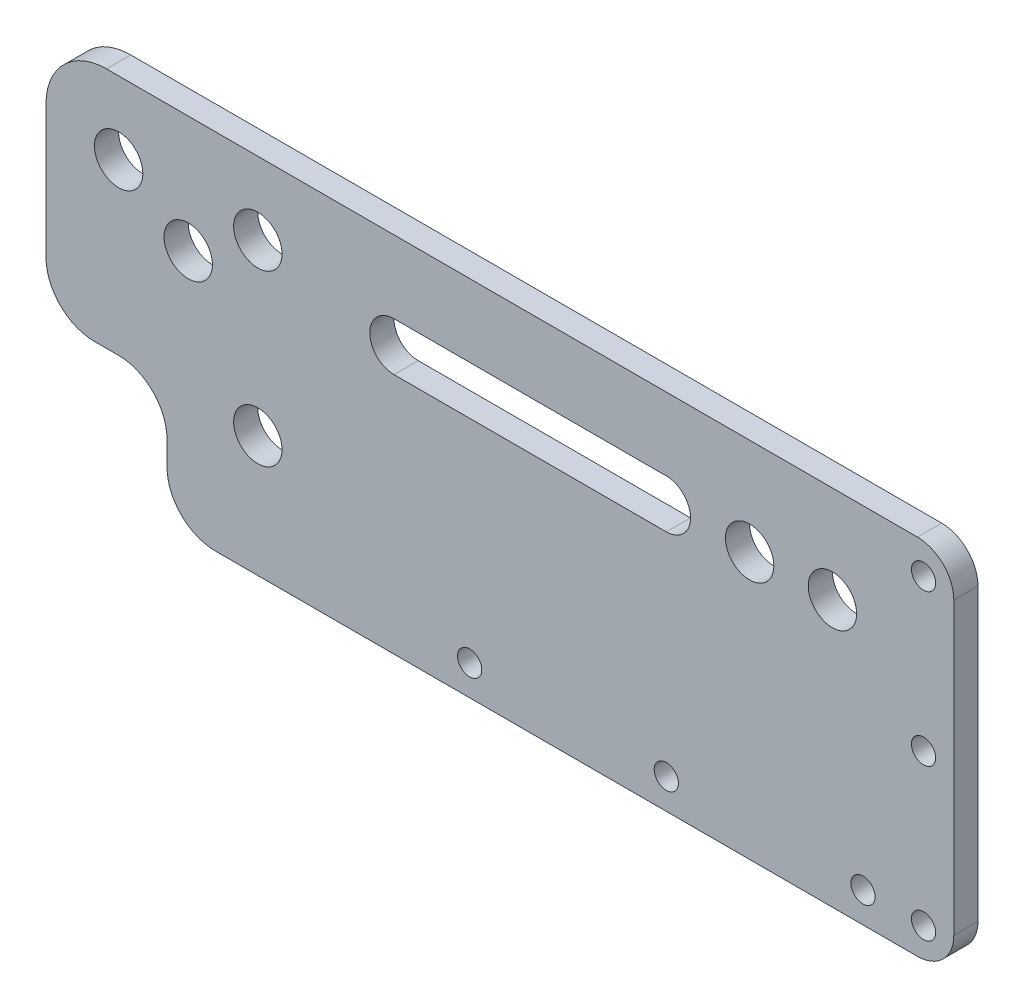
ISO-10303-21;
HEADER;
FILE_DESCRIPTION(('STEP AP214'),'2;1');
FILE_NAME('part.step','',(''),(''),'','','');
FILE_SCHEMA(('AUTOMOTIVE_DESIGN { 1 0 10303 214 1 1 1 1 }'));
ENDSEC;
DATA;
#1=APPLICATION_CONTEXT('core data for automotive mechanical design processes');
#2=APPLICATION_PROTOCOL_DEFINITION('international standard','automotive_design',2000,#1);
#3=PRODUCT_CONTEXT('',#1,'mechanical');
#4=PRODUCT('Part','Part','',(#3));
#5=PRODUCT_RELATED_PRODUCT_CATEGORY('part','',(#4));
#6=PRODUCT_DEFINITION_FORMATION('','',#4);
#7=PRODUCT_DEFINITION_CONTEXT('part definition',#1,'design');
#8=PRODUCT_DEFINITION('design','',#6,#7);
#9=PRODUCT_DEFINITION_SHAPE('','',#8);
#10=(LENGTH_UNIT() NAMED_UNIT(*) SI_UNIT(.MILLI.,.METRE.));
#11=(NAMED_UNIT(*) PLANE_ANGLE_UNIT() SI_UNIT($,.RADIAN.));
#12=(NAMED_UNIT(*) SI_UNIT($,.STERADIAN.) SOLID_ANGLE_UNIT());
#13=UNCERTAINTY_MEASURE_WITH_UNIT(LENGTH_MEASURE(1.E-05),#10,'distance_accuracy_value','');
#14=(GEOMETRIC_REPRESENTATION_CONTEXT(3) GLOBAL_UNCERTAINTY_ASSIGNED_CONTEXT((#13)) GLOBAL_UNIT_ASSIGNED_CONTEXT((#10,
#11,#12)) REPRESENTATION_CONTEXT('',''));
#15=CARTESIAN_POINT('',(0.,0.,0.));
#16=DIRECTION('',(0.,0.,1.));
#17=DIRECTION('',(1.,0.,0.));
#18=AXIS2_PLACEMENT_3D('',#15,#16,#17);
#19=CARTESIAN_POINT('',(28.,8.,4.));
#20=DIRECTION('',(0.,0.,1.));
#21=DIRECTION('',(1.,0.,0.));
#22=AXIS2_PLACEMENT_3D('',#19,#20,#21);
#23=PLANE('',#22);
#24=CARTESIAN_POINT('',(70.,4.99999999999955,4.));
#25=DIRECTION('',(0.,0.,1.));
#26=DIRECTION('',(1.,0.,0.));
#27=AXIS2_PLACEMENT_3D('',#24,#25,#26);
#28=CIRCLE('',#27,2.);
#29=CARTESIAN_POINT('',(72.,4.99999999999955,4.));
#30=VERTEX_POINT('',#29);
#31=EDGE_CURVE('E687',#30,#30,#28,.T.);
#32=ORIENTED_EDGE('',*,*,#31,.F.);
#33=EDGE_LOOP('',(#32));
#34=FACE_BOUND('',#33,.T.);
#35=CARTESIAN_POINT('',(35.,48.,4.));
#36=DIRECTION('',(0.,0.,1.));
#37=DIRECTION('',(1.,0.,0.));
#38=AXIS2_PLACEMENT_3D('',#35,#36,#37);
#39=CIRCLE('',#38,4.00000000000001);
#40=CARTESIAN_POINT('',(39.,48.,4.));
#41=VERTEX_POINT('',#40);
#42=EDGE_CURVE('E703',#41,#41,#39,.T.);
#43=ORIENTED_EDGE('',*,*,#42,.F.);
#44=EDGE_LOOP('',(#43));
#45=FACE_BOUND('',#44,.T.);
#46=CARTESIAN_POINT('',(23.5,40.7198747759699,4.));
#47=DIRECTION('',(0.,0.,1.));
#48=DIRECTION('',(1.,0.,0.));
#49=AXIS2_PLACEMENT_3D('',#46,#47,#48);
#50=CIRCLE('',#49,4.00000000000001);
#51=CARTESIAN_POINT('',(27.5,40.7198747759699,4.));
#52=VERTEX_POINT('',#51);
#53=EDGE_CURVE('E719',#52,#52,#50,.T.);
#54=ORIENTED_EDGE('',*,*,#53,.F.);
#55=EDGE_LOOP('',(#54));
#56=FACE_BOUND('',#55,.T.);
#57=CARTESIAN_POINT('',(135.,5.,4.));
#58=DIRECTION('',(0.,0.,1.));
#59=DIRECTION('',(1.,0.,0.));
#60=AXIS2_PLACEMENT_3D('',#57,#58,#59);
#61=CIRCLE('',#60,2.);
#62=CARTESIAN_POINT('',(137.,5.,4.));
#63=VERTEX_POINT('',#62);
#64=EDGE_CURVE('E735',#63,#63,#61,.T.);
#65=ORIENTED_EDGE('',*,*,#64,.F.);
#66=EDGE_LOOP('',(#65));
#67=FACE_BOUND('',#66,.T.);
#68=CARTESIAN_POINT('',(116.264838239395,44.,4.));
#69=DIRECTION('',(0.,0.,1.));
#70=DIRECTION('',(1.,0.,0.));
#71=AXIS2_PLACEMENT_3D('',#68,#69,#70);
#72=CIRCLE('',#71,4.00000000000001);
#73=CARTESIAN_POINT('',(120.264838239395,44.,4.));
#74=VERTEX_POINT('',#73);
#75=EDGE_CURVE('E190',#74,#74,#72,.T.);
#76=ORIENTED_EDGE('',*,*,#75,.F.);
#77=EDGE_LOOP('',(#76));
#78=FACE_BOUND('',#77,.T.);
#79=CARTESIAN_POINT('',(145.,54.8985603050149,4.));
#80=DIRECTION('',(0.,0.,1.));
#81=DIRECTION('',(1.,0.,0.));
#82=AXIS2_PLACEMENT_3D('',#79,#80,#81);
#83=CIRCLE('',#82,2.);
#84=CARTESIAN_POINT('',(147.,54.8985603050149,4.));
#85=VERTEX_POINT('',#84);
#86=EDGE_CURVE('E214',#85,#85,#83,.T.);
#87=ORIENTED_EDGE('',*,*,#86,.F.);
#88=EDGE_LOOP('',(#87));
#89=FACE_BOUND('',#88,.T.);
#90=CARTESIAN_POINT('',(28.,8.,4.));
#91=DIRECTION('',(0.,0.,1.));
#92=DIRECTION('',(1.,0.,0.));
#93=AXIS2_PLACEMENT_3D('',#90,#91,#92);
#94=CIRCLE('',#93,8.);
#95=CARTESIAN_POINT('',(20.,8.00000000000006,4.));
#96=VERTEX_POINT('',#95);
#97=CARTESIAN_POINT('',(28.0000000000001,0.,4.));
#98=VERTEX_POINT('',#97);
#99=EDGE_CURVE('E222',#96,#98,#94,.T.);
#100=ORIENTED_EDGE('',*,*,#99,.T.);
#101=DIRECTION('',(1.,0.,0.));
#102=VECTOR('',#101,1.);
#103=CARTESIAN_POINT('',(28.0000000000001,0.,4.));
#104=LINE('',#103,#102);
#105=CARTESIAN_POINT('',(144.,0.,4.));
#106=VERTEX_POINT('',#105);
#107=EDGE_CURVE('E226',#98,#106,#104,.T.);
#108=ORIENTED_EDGE('',*,*,#107,.T.);
#109=CARTESIAN_POINT('',(144.,6.,4.));
#110=DIRECTION('',(0.,0.,1.));
#111=DIRECTION('',(1.,0.,0.));
#112=AXIS2_PLACEMENT_3D('',#109,#110,#111);
#113=CIRCLE('',#112,6.);
#114=CARTESIAN_POINT('',(150.,6.00000000000004,4.));
#115=VERTEX_POINT('',#114);
#116=EDGE_CURVE('E230',#106,#115,#113,.T.);
#117=ORIENTED_EDGE('',*,*,#116,.T.);
#118=DIRECTION('',(0.,1.,0.));
#119=VECTOR('',#118,1.);
#120=CARTESIAN_POINT('',(150.,54.,4.));
#121=LINE('',#120,#119);
#122=CARTESIAN_POINT('',(150.,54.,4.));
#123=VERTEX_POINT('',#122);
#124=EDGE_CURVE('E233',#115,#123,#121,.T.);
#125=ORIENTED_EDGE('',*,*,#124,.T.);
#126=CARTESIAN_POINT('',(144.,54.,4.));
#127=DIRECTION('',(0.,0.,1.));
#128=DIRECTION('',(-1.,0.,0.));
#129=AXIS2_PLACEMENT_3D('',#126,#127,#128);
#130=CIRCLE('',#129,6.);
#131=CARTESIAN_POINT('',(144.,60.,4.));
#132=VERTEX_POINT('',#131);
#133=EDGE_CURVE('E236',#123,#132,#130,.T.);
#134=ORIENTED_EDGE('',*,*,#133,.T.);
#135=DIRECTION('',(-1.,0.,0.));
#136=VECTOR('',#135,1.);
#137=CARTESIAN_POINT('',(140.,60.,4.));
#138=LINE('',#137,#136);
#139=CARTESIAN_POINT('',(10.0000000000001,60.,4.));
#140=VERTEX_POINT('',#139);
#141=EDGE_CURVE('E239',#132,#140,#138,.T.);
#142=ORIENTED_EDGE('',*,*,#141,.T.);
#143=CARTESIAN_POINT('',(10.,50.,4.));
#144=DIRECTION('',(0.,0.,1.));
#145=DIRECTION('',(-1.,0.,0.));
#146=AXIS2_PLACEMENT_3D('',#143,#144,#145);
#147=CIRCLE('',#146,10.);
#148=CARTESIAN_POINT('',(0.,49.9999999999999,4.));
#149=VERTEX_POINT('',#148);
#150=EDGE_CURVE('E242',#140,#149,#147,.T.);
#151=ORIENTED_EDGE('',*,*,#150,.T.);
#152=DIRECTION('',(0.,-1.,0.));
#153=VECTOR('',#152,1.);
#154=CARTESIAN_POINT('',(0.,28.0000000000001,4.));
#155=LINE('',#154,#153);
#156=CARTESIAN_POINT('',(0.,28.,4.));
#157=VERTEX_POINT('',#156);
#158=EDGE_CURVE('E245',#149,#157,#155,.T.);
#159=ORIENTED_EDGE('',*,*,#158,.T.);
#160=CARTESIAN_POINT('',(8.,28.,4.));
#161=DIRECTION('',(0.,0.,1.));
#162=DIRECTION('',(-1.,0.,0.));
#163=AXIS2_PLACEMENT_3D('',#160,#161,#162);
#164=CIRCLE('',#163,8.);
#165=CARTESIAN_POINT('',(8.00000000000005,20.,4.));
#166=VERTEX_POINT('',#165);
#167=EDGE_CURVE('E248',#157,#166,#164,.T.);
#168=ORIENTED_EDGE('',*,*,#167,.T.);
#169=DIRECTION('',(1.,0.,0.));
#170=VECTOR('',#169,1.);
#171=CARTESIAN_POINT('',(8.00000000000005,20.,4.));
#172=LINE('',#171,#170);
#173=CARTESIAN_POINT('',(11.9999999999999,20.,4.));
#174=VERTEX_POINT('',#173);
#175=EDGE_CURVE('E251',#166,#174,#172,.T.);
#176=ORIENTED_EDGE('',*,*,#175,.T.);
#177=CARTESIAN_POINT('',(12.,12.,4.));
#178=DIRECTION('',(0.,0.,-1.));
#179=DIRECTION('',(-1.,0.,0.));
#180=AXIS2_PLACEMENT_3D('',#177,#178,#179);
#181=CIRCLE('',#180,8.);
#182=CARTESIAN_POINT('',(20.,11.9999999999999,4.));
#183=VERTEX_POINT('',#182);
#184=EDGE_CURVE('E254',#174,#183,#181,.T.);
#185=ORIENTED_EDGE('',*,*,#184,.T.);
#186=DIRECTION('',(0.,-1.,0.));
#187=VECTOR('',#186,1.);
#188=CARTESIAN_POINT('',(20.,11.9999999999999,4.));
#189=LINE('',#188,#187);
#190=EDGE_CURVE('E257',#183,#96,#189,.T.);
#191=ORIENTED_EDGE('',*,*,#190,.T.);
#192=EDGE_LOOP('',(#100,#108,#117,#125,#134,#142,#151,#159,#168,#176,#185,#191));
#193=FACE_BOUND('',#192,.T.);
#194=CARTESIAN_POINT('',(35.,20.,4.));
#195=DIRECTION('',(0.,0.,1.));
#196=DIRECTION('',(1.,0.,0.));
#197=AXIS2_PLACEMENT_3D('',#194,#195,#196);
#198=CIRCLE('',#197,4.00000000000001);
#199=CARTESIAN_POINT('',(39.,20.,4.));
#200=VERTEX_POINT('',#199);
#201=EDGE_CURVE('E206',#200,#200,#198,.T.);
#202=ORIENTED_EDGE('',*,*,#201,.F.);
#203=EDGE_LOOP('',(#202));
#204=FACE_BOUND('',#203,.T.);
#205=DIRECTION('',(1.,0.,0.));
#206=VECTOR('',#205,1.);
#207=CARTESIAN_POINT('',(57.5,40.,4.));
#208=LINE('',#207,#206);
#209=CARTESIAN_POINT('',(57.5,40.,4.));
#210=VERTEX_POINT('',#209);
#211=CARTESIAN_POINT('',(102.5,40.,4.));
#212=VERTEX_POINT('',#211);
#213=EDGE_CURVE('E164',#210,#212,#208,.T.);
#214=ORIENTED_EDGE('',*,*,#213,.F.);
#215=CARTESIAN_POINT('',(57.5,44.,4.));
#216=DIRECTION('',(0.,0.,1.));
#217=DIRECTION('',(1.,0.,0.));
#218=AXIS2_PLACEMENT_3D('',#215,#216,#217);
#219=CIRCLE('',#218,4.);
#220=CARTESIAN_POINT('',(57.5,48.,4.));
#221=VERTEX_POINT('',#220);
#222=EDGE_CURVE('E155',#221,#210,#219,.T.);
#223=ORIENTED_EDGE('',*,*,#222,.F.);
#224=DIRECTION('',(-1.,0.,0.));
#225=VECTOR('',#224,1.);
#226=CARTESIAN_POINT('',(57.5,48.,4.));
#227=LINE('',#226,#225);
#228=CARTESIAN_POINT('',(102.5,48.,4.));
#229=VERTEX_POINT('',#228);
#230=EDGE_CURVE('E182',#229,#221,#227,.T.);
#231=ORIENTED_EDGE('',*,*,#230,.F.);
#232=CARTESIAN_POINT('',(102.5,44.,4.));
#233=DIRECTION('',(0.,0.,1.));
#234=DIRECTION('',(1.,0.,0.));
#235=AXIS2_PLACEMENT_3D('',#232,#233,#234);
#236=CIRCLE('',#235,4.);
#237=EDGE_CURVE('E178',#212,#229,#236,.T.);
#238=ORIENTED_EDGE('',*,*,#237,.F.);
#239=EDGE_LOOP('',(#214,#223,#231,#238));
#240=FACE_BOUND('',#239,.T.);
#241=CARTESIAN_POINT('',(129.947688146771,44.,4.));
#242=DIRECTION('',(0.,0.,1.));
#243=DIRECTION('',(1.,0.,0.));
#244=AXIS2_PLACEMENT_3D('',#241,#242,#243);
#245=CIRCLE('',#244,3.99999999999999);
#246=CARTESIAN_POINT('',(133.947688146771,44.,4.));
#247=VERTEX_POINT('',#246);
#248=EDGE_CURVE('E743',#247,#247,#245,.T.);
#249=ORIENTED_EDGE('',*,*,#248,.F.);
#250=EDGE_LOOP('',(#249));
#251=FACE_BOUND('',#250,.T.);
#252=CARTESIAN_POINT('',(11.9999999999999,48.,4.));
#253=DIRECTION('',(0.,0.,1.));
#254=DIRECTION('',(1.,0.,0.));
#255=AXIS2_PLACEMENT_3D('',#252,#253,#254);
#256=CIRCLE('',#255,4.00000000000001);
#257=CARTESIAN_POINT('',(16.,48.,4.));
#258=VERTEX_POINT('',#257);
#259=EDGE_CURVE('E727',#258,#258,#256,.T.);
#260=ORIENTED_EDGE('',*,*,#259,.F.);
#261=EDGE_LOOP('',(#260));
#262=FACE_BOUND('',#261,.T.);
#263=CARTESIAN_POINT('',(145.,29.8985603050149,4.));
#264=DIRECTION('',(0.,0.,1.));
#265=DIRECTION('',(1.,0.,0.));
#266=AXIS2_PLACEMENT_3D('',#263,#264,#265);
#267=CIRCLE('',#266,2.);
#268=CARTESIAN_POINT('',(147.,29.8985603050149,4.));
#269=VERTEX_POINT('',#268);
#270=EDGE_CURVE('E711',#269,#269,#267,.T.);
#271=ORIENTED_EDGE('',*,*,#270,.F.);
#272=EDGE_LOOP('',(#271));
#273=FACE_BOUND('',#272,.T.);
#274=CARTESIAN_POINT('',(102.5,4.99999999999977,4.));
#275=DIRECTION('',(0.,0.,1.));
#276=DIRECTION('',(1.,0.,0.));
#277=AXIS2_PLACEMENT_3D('',#274,#275,#276);
#278=CIRCLE('',#277,2.);
#279=CARTESIAN_POINT('',(104.5,4.99999999999977,4.));
#280=VERTEX_POINT('',#279);
#281=EDGE_CURVE('E695',#280,#280,#278,.T.);
#282=ORIENTED_EDGE('',*,*,#281,.F.);
#283=EDGE_LOOP('',(#282));
#284=FACE_BOUND('',#283,.T.);
#285=CARTESIAN_POINT('',(145.000000000001,4.89856030501486,4.));
#286=DIRECTION('',(0.,0.,1.));
#287=DIRECTION('',(1.,0.,0.));
#288=AXIS2_PLACEMENT_3D('',#285,#286,#287);
#289=CIRCLE('',#288,2.);
#290=CARTESIAN_POINT('',(147.000000000001,4.89856030501486,4.));
#291=VERTEX_POINT('',#290);
#292=EDGE_CURVE('E676',#291,#291,#289,.T.);
#293=ORIENTED_EDGE('',*,*,#292,.F.);
#294=EDGE_LOOP('',(#293));
#295=FACE_BOUND('',#294,.T.);
#296=ADVANCED_FACE('F41',(#34,#45,#56,#67,#78,#89,#193,#204,#240,#251,#262,#273,#284,#295),#23,.T.);
#297=CARTESIAN_POINT('',(28.,8.,0.));
#298=DIRECTION('',(0.,0.,1.));
#299=DIRECTION('',(1.,0.,0.));
#300=AXIS2_PLACEMENT_3D('',#297,#298,#299);
#301=PLANE('',#300);
#302=CARTESIAN_POINT('',(35.,20.,0.));
#303=DIRECTION('',(0.,0.,1.));
#304=DIRECTION('',(1.,0.,0.));
#305=AXIS2_PLACEMENT_3D('',#302,#303,#304);
#306=CIRCLE('',#305,4.00000000000001);
#307=CARTESIAN_POINT('',(39.,20.,0.));
#308=VERTEX_POINT('',#307);
#309=EDGE_CURVE('E173',#308,#308,#306,.T.);
#310=ORIENTED_EDGE('',*,*,#309,.T.);
#311=EDGE_LOOP('',(#310));
#312=FACE_BOUND('',#311,.T.);
#313=CARTESIAN_POINT('',(145.,54.8985603050149,0.));
#314=DIRECTION('',(0.,0.,1.));
#315=DIRECTION('',(1.,0.,0.));
#316=AXIS2_PLACEMENT_3D('',#313,#314,#315);
#317=CIRCLE('',#316,2.);
#318=CARTESIAN_POINT('',(147.,54.8985603050149,0.));
#319=VERTEX_POINT('',#318);
#320=EDGE_CURVE('E210',#319,#319,#317,.T.);
#321=ORIENTED_EDGE('',*,*,#320,.T.);
#322=EDGE_LOOP('',(#321));
#323=FACE_BOUND('',#322,.T.);
#324=CARTESIAN_POINT('',(28.,8.,0.));
#325=DIRECTION('',(0.,0.,1.));
#326=DIRECTION('',(1.,0.,0.));
#327=AXIS2_PLACEMENT_3D('',#324,#325,#326);
#328=CIRCLE('',#327,8.);
#329=CARTESIAN_POINT('',(20.,8.00000000000006,0.));
#330=VERTEX_POINT('',#329);
#331=CARTESIAN_POINT('',(28.0000000000001,0.,0.));
#332=VERTEX_POINT('',#331);
#333=EDGE_CURVE('E218',#330,#332,#328,.T.);
#334=ORIENTED_EDGE('',*,*,#333,.F.);
#335=DIRECTION('',(0.,-1.,0.));
#336=VECTOR('',#335,1.);
#337=CARTESIAN_POINT('',(20.,11.9999999999999,0.));
#338=LINE('',#337,#336);
#339=CARTESIAN_POINT('',(20.,11.9999999999999,0.));
#340=VERTEX_POINT('',#339);
#341=EDGE_CURVE('E227',#340,#330,#338,.T.);
#342=ORIENTED_EDGE('',*,*,#341,.F.);
#343=CARTESIAN_POINT('',(12.,12.,0.));
#344=DIRECTION('',(0.,0.,-1.));
#345=DIRECTION('',(-1.,0.,0.));
#346=AXIS2_PLACEMENT_3D('',#343,#344,#345);
#347=CIRCLE('',#346,8.);
#348=CARTESIAN_POINT('',(11.9999999999999,20.,0.));
#349=VERTEX_POINT('',#348);
#350=EDGE_CURVE('E292',#349,#340,#347,.T.);
#351=ORIENTED_EDGE('',*,*,#350,.F.);
#352=DIRECTION('',(1.,0.,0.));
#353=VECTOR('',#352,1.);
#354=CARTESIAN_POINT('',(8.00000000000005,20.,0.));
#355=LINE('',#354,#353);
#356=CARTESIAN_POINT('',(8.00000000000005,20.,0.));
#357=VERTEX_POINT('',#356);
#358=EDGE_CURVE('E289',#357,#349,#355,.T.);
#359=ORIENTED_EDGE('',*,*,#358,.F.);
#360=CARTESIAN_POINT('',(8.,28.,0.));
#361=DIRECTION('',(0.,0.,1.));
#362=DIRECTION('',(-1.,0.,0.));
#363=AXIS2_PLACEMENT_3D('',#360,#361,#362);
#364=CIRCLE('',#363,8.);
#365=CARTESIAN_POINT('',(0.,28.,0.));
#366=VERTEX_POINT('',#365);
#367=EDGE_CURVE('E286',#366,#357,#364,.T.);
#368=ORIENTED_EDGE('',*,*,#367,.F.);
#369=DIRECTION('',(0.,-1.,0.));
#370=VECTOR('',#369,1.);
#371=CARTESIAN_POINT('',(0.,28.0000000000001,0.));
#372=LINE('',#371,#370);
#373=CARTESIAN_POINT('',(0.,49.9999999999999,0.));
#374=VERTEX_POINT('',#373);
#375=EDGE_CURVE('E283',#374,#366,#372,.T.);
#376=ORIENTED_EDGE('',*,*,#375,.F.);
#377=CARTESIAN_POINT('',(10.,50.,0.));
#378=DIRECTION('',(0.,0.,1.));
#379=DIRECTION('',(-1.,0.,0.));
#380=AXIS2_PLACEMENT_3D('',#377,#378,#379);
#381=CIRCLE('',#380,10.);
#382=CARTESIAN_POINT('',(10.0000000000001,60.,0.));
#383=VERTEX_POINT('',#382);
#384=EDGE_CURVE('E280',#383,#374,#381,.T.);
#385=ORIENTED_EDGE('',*,*,#384,.F.);
#386=DIRECTION('',(-1.,0.,0.));
#387=VECTOR('',#386,1.);
#388=CARTESIAN_POINT('',(10.0000000000001,60.,0.));
#389=LINE('',#388,#387);
#390=CARTESIAN_POINT('',(144.,60.,0.));
#391=VERTEX_POINT('',#390);
#392=EDGE_CURVE('E277',#391,#383,#389,.T.);
#393=ORIENTED_EDGE('',*,*,#392,.F.);
#394=CARTESIAN_POINT('',(144.,54.,0.));
#395=DIRECTION('',(0.,0.,1.));
#396=DIRECTION('',(-1.,0.,0.));
#397=AXIS2_PLACEMENT_3D('',#394,#395,#396);
#398=CIRCLE('',#397,6.);
#399=CARTESIAN_POINT('',(150.,54.,0.));
#400=VERTEX_POINT('',#399);
#401=EDGE_CURVE('E273',#400,#391,#398,.T.);
#402=ORIENTED_EDGE('',*,*,#401,.F.);
#403=DIRECTION('',(0.,1.,0.));
#404=VECTOR('',#403,1.);
#405=CARTESIAN_POINT('',(150.,54.,0.));
#406=LINE('',#405,#404);
#407=CARTESIAN_POINT('',(150.,6.00000000000004,0.));
#408=VERTEX_POINT('',#407);
#409=EDGE_CURVE('E270',#408,#400,#406,.T.);
#410=ORIENTED_EDGE('',*,*,#409,.F.);
#411=CARTESIAN_POINT('',(144.,6.,0.));
#412=DIRECTION('',(0.,0.,1.));
#413=DIRECTION('',(1.,0.,0.));
#414=AXIS2_PLACEMENT_3D('',#411,#412,#413);
#415=CIRCLE('',#414,6.);
#416=CARTESIAN_POINT('',(144.,0.,0.));
#417=VERTEX_POINT('',#416);
#418=EDGE_CURVE('E267',#417,#408,#415,.T.);
#419=ORIENTED_EDGE('',*,*,#418,.F.);
#420=DIRECTION('',(1.,0.,0.));
#421=VECTOR('',#420,1.);
#422=CARTESIAN_POINT('',(140.,0.,0.));
#423=LINE('',#422,#421);
#424=EDGE_CURVE('E264',#332,#417,#423,.T.);
#425=ORIENTED_EDGE('',*,*,#424,.F.);
#426=EDGE_LOOP('',(#334,#342,#351,#359,#368,#376,#385,#393,#402,#410,#419,#425));
#427=FACE_BOUND('',#426,.T.);
#428=CARTESIAN_POINT('',(57.5,44.,0.));
#429=DIRECTION('',(0.,0.,1.));
#430=DIRECTION('',(1.,0.,0.));
#431=AXIS2_PLACEMENT_3D('',#428,#429,#430);
#432=CIRCLE('',#431,4.);
#433=CARTESIAN_POINT('',(57.5,48.,0.));
#434=VERTEX_POINT('',#433);
#435=CARTESIAN_POINT('',(57.5,40.,0.));
#436=VERTEX_POINT('',#435);
#437=EDGE_CURVE('E65',#434,#436,#432,.T.);
#438=ORIENTED_EDGE('',*,*,#437,.T.);
#439=DIRECTION('',(1.,0.,0.));
#440=VECTOR('',#439,1.);
#441=CARTESIAN_POINT('',(57.5,40.,0.));
#442=LINE('',#441,#440);
#443=CARTESIAN_POINT('',(102.5,40.,0.));
#444=VERTEX_POINT('',#443);
#445=EDGE_CURVE('E171',#436,#444,#442,.T.);
#446=ORIENTED_EDGE('',*,*,#445,.T.);
#447=CARTESIAN_POINT('',(102.5,44.,0.));
#448=DIRECTION('',(0.,0.,1.));
#449=DIRECTION('',(1.,0.,0.));
#450=AXIS2_PLACEMENT_3D('',#447,#448,#449);
#451=CIRCLE('',#450,4.);
#452=CARTESIAN_POINT('',(102.5,48.,0.));
#453=VERTEX_POINT('',#452);
#454=EDGE_CURVE('E193',#444,#453,#451,.T.);
#455=ORIENTED_EDGE('',*,*,#454,.T.);
#456=DIRECTION('',(-1.,0.,0.));
#457=VECTOR('',#456,1.);
#458=CARTESIAN_POINT('',(57.5,48.,0.));
#459=LINE('',#458,#457);
#460=EDGE_CURVE('E165',#453,#434,#459,.T.);
#461=ORIENTED_EDGE('',*,*,#460,.T.);
#462=EDGE_LOOP('',(#438,#446,#455,#461));
#463=FACE_BOUND('',#462,.T.);
#464=CARTESIAN_POINT('',(116.264838239395,44.,0.));
#465=DIRECTION('',(0.,0.,1.));
#466=DIRECTION('',(1.,0.,0.));
#467=AXIS2_PLACEMENT_3D('',#464,#465,#466);
#468=CIRCLE('',#467,4.00000000000001);
#469=CARTESIAN_POINT('',(120.264838239395,44.,0.));
#470=VERTEX_POINT('',#469);
#471=EDGE_CURVE('E747',#470,#470,#468,.T.);
#472=ORIENTED_EDGE('',*,*,#471,.T.);
#473=EDGE_LOOP('',(#472));
#474=FACE_BOUND('',#473,.T.);
#475=CARTESIAN_POINT('',(129.947688146771,44.,0.));
#476=DIRECTION('',(0.,0.,1.));
#477=DIRECTION('',(1.,0.,0.));
#478=AXIS2_PLACEMENT_3D('',#475,#476,#477);
#479=CIRCLE('',#478,3.99999999999999);
#480=CARTESIAN_POINT('',(133.947688146771,44.,0.));
#481=VERTEX_POINT('',#480);
#482=EDGE_CURVE('E739',#481,#481,#479,.T.);
#483=ORIENTED_EDGE('',*,*,#482,.T.);
#484=EDGE_LOOP('',(#483));
#485=FACE_BOUND('',#484,.T.);
#486=CARTESIAN_POINT('',(135.,5.,0.));
#487=DIRECTION('',(0.,0.,1.));
#488=DIRECTION('',(1.,0.,0.));
#489=AXIS2_PLACEMENT_3D('',#486,#487,#488);
#490=CIRCLE('',#489,2.);
#491=CARTESIAN_POINT('',(137.,5.,0.));
#492=VERTEX_POINT('',#491);
#493=EDGE_CURVE('E731',#492,#492,#490,.T.);
#494=ORIENTED_EDGE('',*,*,#493,.T.);
#495=EDGE_LOOP('',(#494));
#496=FACE_BOUND('',#495,.T.);
#497=CARTESIAN_POINT('',(11.9999999999999,48.,0.));
#498=DIRECTION('',(0.,0.,1.));
#499=DIRECTION('',(1.,0.,0.));
#500=AXIS2_PLACEMENT_3D('',#497,#498,#499);
#501=CIRCLE('',#500,4.00000000000001);
#502=CARTESIAN_POINT('',(16.,48.,0.));
#503=VERTEX_POINT('',#502);
#504=EDGE_CURVE('E723',#503,#503,#501,.T.);
#505=ORIENTED_EDGE('',*,*,#504,.T.);
#506=EDGE_LOOP('',(#505));
#507=FACE_BOUND('',#506,.T.);
#508=CARTESIAN_POINT('',(23.5,40.7198747759699,0.));
#509=DIRECTION('',(0.,0.,1.));
#510=DIRECTION('',(1.,0.,0.));
#511=AXIS2_PLACEMENT_3D('',#508,#509,#510);
#512=CIRCLE('',#511,4.00000000000001);
#513=CARTESIAN_POINT('',(27.5,40.7198747759699,0.));
#514=VERTEX_POINT('',#513);
#515=EDGE_CURVE('E715',#514,#514,#512,.T.);
#516=ORIENTED_EDGE('',*,*,#515,.T.);
#517=EDGE_LOOP('',(#516));
#518=FACE_BOUND('',#517,.T.);
#519=CARTESIAN_POINT('',(145.,29.8985603050149,0.));
#520=DIRECTION('',(0.,0.,1.));
#521=DIRECTION('',(1.,0.,0.));
#522=AXIS2_PLACEMENT_3D('',#519,#520,#521);
#523=CIRCLE('',#522,2.);
#524=CARTESIAN_POINT('',(147.,29.8985603050149,0.));
#525=VERTEX_POINT('',#524);
#526=EDGE_CURVE('E707',#525,#525,#523,.T.);
#527=ORIENTED_EDGE('',*,*,#526,.T.);
#528=EDGE_LOOP('',(#527));
#529=FACE_BOUND('',#528,.T.);
#530=CARTESIAN_POINT('',(35.,48.,0.));
#531=DIRECTION('',(0.,0.,1.));
#532=DIRECTION('',(1.,0.,0.));
#533=AXIS2_PLACEMENT_3D('',#530,#531,#532);
#534=CIRCLE('',#533,4.00000000000001);
#535=CARTESIAN_POINT('',(39.,48.,0.));
#536=VERTEX_POINT('',#535);
#537=EDGE_CURVE('E699',#536,#536,#534,.T.);
#538=ORIENTED_EDGE('',*,*,#537,.T.);
#539=EDGE_LOOP('',(#538));
#540=FACE_BOUND('',#539,.T.);
#541=CARTESIAN_POINT('',(102.5,4.99999999999977,0.));
#542=DIRECTION('',(0.,0.,1.));
#543=DIRECTION('',(1.,0.,0.));
#544=AXIS2_PLACEMENT_3D('',#541,#542,#543);
#545=CIRCLE('',#544,2.);
#546=CARTESIAN_POINT('',(104.5,4.99999999999977,0.));
#547=VERTEX_POINT('',#546);
#548=EDGE_CURVE('E691',#547,#547,#545,.T.);
#549=ORIENTED_EDGE('',*,*,#548,.T.);
#550=EDGE_LOOP('',(#549));
#551=FACE_BOUND('',#550,.T.);
#552=CARTESIAN_POINT('',(70.,4.99999999999955,0.));
#553=DIRECTION('',(0.,0.,1.));
#554=DIRECTION('',(1.,0.,0.));
#555=AXIS2_PLACEMENT_3D('',#552,#553,#554);
#556=CIRCLE('',#555,2.);
#557=CARTESIAN_POINT('',(72.,4.99999999999955,0.));
#558=VERTEX_POINT('',#557);
#559=EDGE_CURVE('E684',#558,#558,#556,.T.);
#560=ORIENTED_EDGE('',*,*,#559,.T.);
#561=EDGE_LOOP('',(#560));
#562=FACE_BOUND('',#561,.T.);
#563=CARTESIAN_POINT('',(145.000000000001,4.89856030501486,0.));
#564=DIRECTION('',(0.,0.,1.));
#565=DIRECTION('',(1.,0.,0.));
#566=AXIS2_PLACEMENT_3D('',#563,#564,#565);
#567=CIRCLE('',#566,2.);
#568=CARTESIAN_POINT('',(147.000000000001,4.89856030501486,0.));
#569=VERTEX_POINT('',#568);
#570=EDGE_CURVE('E679',#569,#569,#567,.T.);
#571=ORIENTED_EDGE('',*,*,#570,.T.);
#572=EDGE_LOOP('',(#571));
#573=FACE_BOUND('',#572,.T.);
#574=ADVANCED_FACE('F347',(#312,#323,#427,#463,#474,#485,#496,#507,#518,#529,#540,#551,#562,
#573),#301,.F.);
#575=CARTESIAN_POINT('',(28.,8.,4.));
#576=DIRECTION('',(0.,0.,-1.));
#577=DIRECTION('',(-1.,0.,0.));
#578=AXIS2_PLACEMENT_3D('',#575,#576,#577);
#579=CYLINDRICAL_SURFACE('',#578,8.);
#580=ORIENTED_EDGE('',*,*,#333,.T.);
#581=DIRECTION('',(0.,0.,-1.));
#582=VECTOR('',#581,1.);
#583=CARTESIAN_POINT('',(28.0000000000001,0.,4.));
#584=LINE('',#583,#582);
#585=EDGE_CURVE('E11',#98,#332,#584,.T.);
#586=ORIENTED_EDGE('',*,*,#585,.F.);
#587=ORIENTED_EDGE('',*,*,#99,.F.);
#588=DIRECTION('',(0.,0.,-1.));
#589=VECTOR('',#588,1.);
#590=CARTESIAN_POINT('',(20.,8.00000000000006,4.));
#591=LINE('',#590,#589);
#592=EDGE_CURVE('E260',#96,#330,#591,.T.);
#593=ORIENTED_EDGE('',*,*,#592,.T.);
#594=EDGE_LOOP('',(#580,#586,#587,#593));
#595=FACE_BOUND('',#594,.T.);
#596=ADVANCED_FACE('F43',(#595),#579,.T.);
#597=CARTESIAN_POINT('',(140.,0.,4.));
#598=DIRECTION('',(0.,1.,0.));
#599=DIRECTION('',(0.,0.,1.));
#600=AXIS2_PLACEMENT_3D('',#597,#598,#599);
#601=PLANE('',#600);
#602=ORIENTED_EDGE('',*,*,#424,.T.);
#603=DIRECTION('',(0.,0.,-1.));
#604=VECTOR('',#603,1.);
#605=CARTESIAN_POINT('',(144.,0.,4.));
#606=LINE('',#605,#604);
#607=EDGE_CURVE('E50',#106,#417,#606,.T.);
#608=ORIENTED_EDGE('',*,*,#607,.F.);
#609=ORIENTED_EDGE('',*,*,#107,.F.);
#610=ORIENTED_EDGE('',*,*,#585,.T.);
#611=EDGE_LOOP('',(#602,#608,#609,#610));
#612=FACE_BOUND('',#611,.T.);
#613=ADVANCED_FACE('F364',(#612),#601,.F.);
#614=CARTESIAN_POINT('',(144.,6.,4.));
#615=DIRECTION('',(0.,0.,-1.));
#616=DIRECTION('',(-1.,0.,0.));
#617=AXIS2_PLACEMENT_3D('',#614,#615,#616);
#618=CYLINDRICAL_SURFACE('',#617,6.);
#619=ORIENTED_EDGE('',*,*,#418,.T.);
#620=DIRECTION('',(0.,0.,-1.));
#621=VECTOR('',#620,1.);
#622=CARTESIAN_POINT('',(150.,6.00000000000004,4.));
#623=LINE('',#622,#621);
#624=EDGE_CURVE('E332',#115,#408,#623,.T.);
#625=ORIENTED_EDGE('',*,*,#624,.F.);
#626=ORIENTED_EDGE('',*,*,#116,.F.);
#627=ORIENTED_EDGE('',*,*,#607,.T.);
#628=EDGE_LOOP('',(#619,#625,#626,#627));
#629=FACE_BOUND('',#628,.T.);
#630=ADVANCED_FACE('F341',(#629),#618,.T.);
#631=CARTESIAN_POINT('',(150.,54.,4.));
#632=DIRECTION('',(-1.,0.,0.));
#633=DIRECTION('',(0.,0.,1.));
#634=AXIS2_PLACEMENT_3D('',#631,#632,#633);
#635=PLANE('',#634);
#636=ORIENTED_EDGE('',*,*,#409,.T.);
#637=DIRECTION('',(0.,0.,-1.));
#638=VECTOR('',#637,1.);
#639=CARTESIAN_POINT('',(150.,54.,4.));
#640=LINE('',#639,#638);
#641=EDGE_CURVE('E328',#123,#400,#640,.T.);
#642=ORIENTED_EDGE('',*,*,#641,.F.);
#643=ORIENTED_EDGE('',*,*,#124,.F.);
#644=ORIENTED_EDGE('',*,*,#624,.T.);
#645=EDGE_LOOP('',(#636,#642,#643,#644));
#646=FACE_BOUND('',#645,.T.);
#647=ADVANCED_FACE('F352',(#646),#635,.F.);
#648=CARTESIAN_POINT('',(144.,54.,4.));
#649=DIRECTION('',(0.,0.,-1.));
#650=DIRECTION('',(-1.,0.,0.));
#651=AXIS2_PLACEMENT_3D('',#648,#649,#650);
#652=CYLINDRICAL_SURFACE('',#651,6.);
#653=ORIENTED_EDGE('',*,*,#401,.T.);
#654=DIRECTION('',(0.,0.,-1.));
#655=VECTOR('',#654,1.);
#656=CARTESIAN_POINT('',(144.,60.,4.));
#657=LINE('',#656,#655);
#658=EDGE_CURVE('E324',#132,#391,#657,.T.);
#659=ORIENTED_EDGE('',*,*,#658,.F.);
#660=ORIENTED_EDGE('',*,*,#133,.F.);
#661=ORIENTED_EDGE('',*,*,#641,.T.);
#662=EDGE_LOOP('',(#653,#659,#660,#661));
#663=FACE_BOUND('',#662,.T.);
#664=ADVANCED_FACE('F356',(#663),#652,.T.);
#665=CARTESIAN_POINT('',(10.0000000000001,60.,4.));
#666=DIRECTION('',(0.,-1.,0.));
#667=DIRECTION('',(0.,0.,-1.));
#668=AXIS2_PLACEMENT_3D('',#665,#666,#667);
#669=PLANE('',#668);
#670=ORIENTED_EDGE('',*,*,#392,.T.);
#671=DIRECTION('',(0.,0.,-1.));
#672=VECTOR('',#671,1.);
#673=CARTESIAN_POINT('',(10.0000000000001,60.,4.));
#674=LINE('',#673,#672);
#675=EDGE_CURVE('E320',#140,#383,#674,.T.);
#676=ORIENTED_EDGE('',*,*,#675,.F.);
#677=ORIENTED_EDGE('',*,*,#141,.F.);
#678=ORIENTED_EDGE('',*,*,#658,.T.);
#679=EDGE_LOOP('',(#670,#676,#677,#678));
#680=FACE_BOUND('',#679,.T.);
#681=ADVANCED_FACE('F397',(#680),#669,.F.);
#682=CARTESIAN_POINT('',(10.,50.,4.));
#683=DIRECTION('',(0.,0.,-1.));
#684=DIRECTION('',(-1.,0.,0.));
#685=AXIS2_PLACEMENT_3D('',#682,#683,#684);
#686=CYLINDRICAL_SURFACE('',#685,10.);
#687=ORIENTED_EDGE('',*,*,#384,.T.);
#688=DIRECTION('',(0.,0.,-1.));
#689=VECTOR('',#688,1.);
#690=CARTESIAN_POINT('',(0.,49.9999999999999,4.));
#691=LINE('',#690,#689);
#692=EDGE_CURVE('E316',#149,#374,#691,.T.);
#693=ORIENTED_EDGE('',*,*,#692,.F.);
#694=ORIENTED_EDGE('',*,*,#150,.F.);
#695=ORIENTED_EDGE('',*,*,#675,.T.);
#696=EDGE_LOOP('',(#687,#693,#694,#695));
#697=FACE_BOUND('',#696,.T.);
#698=ADVANCED_FACE('F395',(#697),#686,.T.);
#699=CARTESIAN_POINT('',(0.,28.0000000000001,4.));
#700=DIRECTION('',(1.,0.,0.));
#701=DIRECTION('',(0.,1.,0.));
#702=AXIS2_PLACEMENT_3D('',#699,#700,#701);
#703=PLANE('',#702);
#704=ORIENTED_EDGE('',*,*,#375,.T.);
#705=DIRECTION('',(0.,0.,-1.));
#706=VECTOR('',#705,1.);
#707=CARTESIAN_POINT('',(0.,28.,4.));
#708=LINE('',#707,#706);
#709=EDGE_CURVE('E312',#157,#366,#708,.T.);
#710=ORIENTED_EDGE('',*,*,#709,.F.);
#711=ORIENTED_EDGE('',*,*,#158,.F.);
#712=ORIENTED_EDGE('',*,*,#692,.T.);
#713=EDGE_LOOP('',(#704,#710,#711,#712));
#714=FACE_BOUND('',#713,.T.);
#715=ADVANCED_FACE('F391',(#714),#703,.F.);
#716=CARTESIAN_POINT('',(8.,28.,4.));
#717=DIRECTION('',(0.,0.,-1.));
#718=DIRECTION('',(-1.,0.,0.));
#719=AXIS2_PLACEMENT_3D('',#716,#717,#718);
#720=CYLINDRICAL_SURFACE('',#719,8.);
#721=ORIENTED_EDGE('',*,*,#367,.T.);
#722=DIRECTION('',(0.,0.,-1.));
#723=VECTOR('',#722,1.);
#724=CARTESIAN_POINT('',(8.00000000000005,20.,4.));
#725=LINE('',#724,#723);
#726=EDGE_CURVE('E308',#166,#357,#725,.T.);
#727=ORIENTED_EDGE('',*,*,#726,.F.);
#728=ORIENTED_EDGE('',*,*,#167,.F.);
#729=ORIENTED_EDGE('',*,*,#709,.T.);
#730=EDGE_LOOP('',(#721,#727,#728,#729));
#731=FACE_BOUND('',#730,.T.);
#732=ADVANCED_FACE('F386',(#731),#720,.T.);
#733=CARTESIAN_POINT('',(8.00000000000005,20.,4.));
#734=DIRECTION('',(0.,1.,0.));
#735=DIRECTION('',(0.,0.,1.));
#736=AXIS2_PLACEMENT_3D('',#733,#734,#735);
#737=PLANE('',#736);
#738=ORIENTED_EDGE('',*,*,#358,.T.);
#739=DIRECTION('',(0.,0.,-1.));
#740=VECTOR('',#739,1.);
#741=CARTESIAN_POINT('',(11.9999999999999,20.,4.));
#742=LINE('',#741,#740);
#743=EDGE_CURVE('E304',#174,#349,#742,.T.);
#744=ORIENTED_EDGE('',*,*,#743,.F.);
#745=ORIENTED_EDGE('',*,*,#175,.F.);
#746=ORIENTED_EDGE('',*,*,#726,.T.);
#747=EDGE_LOOP('',(#738,#744,#745,#746));
#748=FACE_BOUND('',#747,.T.);
#749=ADVANCED_FACE('F380',(#748),#737,.F.);
#750=CARTESIAN_POINT('',(12.,12.,4.));
#751=DIRECTION('',(0.,0.,-1.));
#752=DIRECTION('',(-1.,0.,0.));
#753=AXIS2_PLACEMENT_3D('',#750,#751,#752);
#754=CYLINDRICAL_SURFACE('',#753,8.);
#755=ORIENTED_EDGE('',*,*,#350,.T.);
#756=DIRECTION('',(0.,0.,-1.));
#757=VECTOR('',#756,1.);
#758=CARTESIAN_POINT('',(20.,11.9999999999999,4.));
#759=LINE('',#758,#757);
#760=EDGE_CURVE('E300',#183,#340,#759,.T.);
#761=ORIENTED_EDGE('',*,*,#760,.F.);
#762=ORIENTED_EDGE('',*,*,#184,.F.);
#763=ORIENTED_EDGE('',*,*,#743,.T.);
#764=EDGE_LOOP('',(#755,#761,#762,#763));
#765=FACE_BOUND('',#764,.T.);
#766=ADVANCED_FACE('F376',(#765),#754,.F.);
#767=CARTESIAN_POINT('',(20.,11.9999999999999,4.));
#768=DIRECTION('',(1.,0.,0.));
#769=DIRECTION('',(0.,0.,-1.));
#770=AXIS2_PLACEMENT_3D('',#767,#768,#769);
#771=PLANE('',#770);
#772=ORIENTED_EDGE('',*,*,#341,.T.);
#773=ORIENTED_EDGE('',*,*,#592,.F.);
#774=ORIENTED_EDGE('',*,*,#190,.F.);
#775=ORIENTED_EDGE('',*,*,#760,.T.);
#776=EDGE_LOOP('',(#772,#773,#774,#775));
#777=FACE_BOUND('',#776,.T.);
#778=ADVANCED_FACE('F371',(#777),#771,.F.);
#779=CARTESIAN_POINT('',(145.,54.8985603050149,4.));
#780=DIRECTION('',(0.,0.,-1.));
#781=DIRECTION('',(-1.,0.,0.));
#782=AXIS2_PLACEMENT_3D('',#779,#780,#781);
#783=CYLINDRICAL_SURFACE('',#782,2.);
#784=ORIENTED_EDGE('',*,*,#86,.T.);
#785=EDGE_LOOP('',(#784));
#786=FACE_BOUND('',#785,.T.);
#787=ORIENTED_EDGE('',*,*,#320,.F.);
#788=EDGE_LOOP('',(#787));
#789=FACE_BOUND('',#788,.T.);
#790=ADVANCED_FACE('F417',(#786,#789),#783,.F.);
#791=CARTESIAN_POINT('',(35.,20.,4.));
#792=DIRECTION('',(0.,0.,-1.));
#793=DIRECTION('',(-1.,0.,0.));
#794=AXIS2_PLACEMENT_3D('',#791,#792,#793);
#795=CYLINDRICAL_SURFACE('',#794,4.00000000000001);
#796=ORIENTED_EDGE('',*,*,#201,.T.);
#797=EDGE_LOOP('',(#796));
#798=FACE_BOUND('',#797,.T.);
#799=ORIENTED_EDGE('',*,*,#309,.F.);
#800=EDGE_LOOP('',(#799));
#801=FACE_BOUND('',#800,.T.);
#802=ADVANCED_FACE('F455',(#798,#801),#795,.F.);
#803=CARTESIAN_POINT('',(57.5,44.,4.));
#804=DIRECTION('',(0.,0.,-1.));
#805=DIRECTION('',(-1.,0.,0.));
#806=AXIS2_PLACEMENT_3D('',#803,#804,#805);
#807=CYLINDRICAL_SURFACE('',#806,4.);
#808=ORIENTED_EDGE('',*,*,#437,.F.);
#809=DIRECTION('',(0.,0.,-1.));
#810=VECTOR('',#809,1.);
#811=CARTESIAN_POINT('',(57.5,48.,4.));
#812=LINE('',#811,#810);
#813=EDGE_CURVE('E159',#221,#434,#812,.T.);
#814=ORIENTED_EDGE('',*,*,#813,.F.);
#815=ORIENTED_EDGE('',*,*,#222,.T.);
#816=DIRECTION('',(0.,0.,-1.));
#817=VECTOR('',#816,1.);
#818=CARTESIAN_POINT('',(57.5,40.,4.));
#819=LINE('',#818,#817);
#820=EDGE_CURVE('E158',#210,#436,#819,.T.);
#821=ORIENTED_EDGE('',*,*,#820,.T.);
#822=EDGE_LOOP('',(#808,#814,#815,#821));
#823=FACE_BOUND('',#822,.T.);
#824=ADVANCED_FACE('F157',(#823),#807,.F.);
#825=CARTESIAN_POINT('',(57.5,40.,4.));
#826=DIRECTION('',(0.,1.,0.));
#827=DIRECTION('',(-1.,0.,0.));
#828=AXIS2_PLACEMENT_3D('',#825,#826,#827);
#829=PLANE('',#828);
#830=ORIENTED_EDGE('',*,*,#445,.F.);
#831=ORIENTED_EDGE('',*,*,#820,.F.);
#832=ORIENTED_EDGE('',*,*,#213,.T.);
#833=DIRECTION('',(0.,0.,-1.));
#834=VECTOR('',#833,1.);
#835=CARTESIAN_POINT('',(102.5,40.,4.));
#836=LINE('',#835,#834);
#837=EDGE_CURVE('E174',#212,#444,#836,.T.);
#838=ORIENTED_EDGE('',*,*,#837,.T.);
#839=EDGE_LOOP('',(#830,#831,#832,#838));
#840=FACE_BOUND('',#839,.T.);
#841=ADVANCED_FACE('F168',(#840),#829,.T.);
#842=CARTESIAN_POINT('',(102.5,44.,4.));
#843=DIRECTION('',(0.,0.,-1.));
#844=DIRECTION('',(-1.,0.,0.));
#845=AXIS2_PLACEMENT_3D('',#842,#843,#844);
#846=CYLINDRICAL_SURFACE('',#845,4.);
#847=ORIENTED_EDGE('',*,*,#454,.F.);
#848=ORIENTED_EDGE('',*,*,#837,.F.);
#849=ORIENTED_EDGE('',*,*,#237,.T.);
#850=DIRECTION('',(0.,0.,-1.));
#851=VECTOR('',#850,1.);
#852=CARTESIAN_POINT('',(102.5,48.,4.));
#853=LINE('',#852,#851);
#854=EDGE_CURVE('E57',#229,#453,#853,.T.);
#855=ORIENTED_EDGE('',*,*,#854,.T.);
#856=EDGE_LOOP('',(#847,#848,#849,#855));
#857=FACE_BOUND('',#856,.T.);
#858=ADVANCED_FACE('F474',(#857),#846,.F.);
#859=CARTESIAN_POINT('',(57.5,48.,4.));
#860=DIRECTION('',(0.,-1.,0.));
#861=DIRECTION('',(1.,0.,0.));
#862=AXIS2_PLACEMENT_3D('',#859,#860,#861);
#863=PLANE('',#862);
#864=ORIENTED_EDGE('',*,*,#460,.F.);
#865=ORIENTED_EDGE('',*,*,#854,.F.);
#866=ORIENTED_EDGE('',*,*,#230,.T.);
#867=ORIENTED_EDGE('',*,*,#813,.T.);
#868=EDGE_LOOP('',(#864,#865,#866,#867));
#869=FACE_BOUND('',#868,.T.);
#870=ADVANCED_FACE('F481',(#869),#863,.T.);
#871=CARTESIAN_POINT('',(116.264838239395,44.,4.));
#872=DIRECTION('',(0.,0.,-1.));
#873=DIRECTION('',(-1.,0.,0.));
#874=AXIS2_PLACEMENT_3D('',#871,#872,#873);
#875=CYLINDRICAL_SURFACE('',#874,4.00000000000001);
#876=ORIENTED_EDGE('',*,*,#75,.T.);
#877=EDGE_LOOP('',(#876));
#878=FACE_BOUND('',#877,.T.);
#879=ORIENTED_EDGE('',*,*,#471,.F.);
#880=EDGE_LOOP('',(#879));
#881=FACE_BOUND('',#880,.T.);
#882=ADVANCED_FACE('F489',(#878,#881),#875,.F.);
#883=CARTESIAN_POINT('',(129.947688146771,44.,4.));
#884=DIRECTION('',(0.,0.,-1.));
#885=DIRECTION('',(-1.,0.,0.));
#886=AXIS2_PLACEMENT_3D('',#883,#884,#885);
#887=CYLINDRICAL_SURFACE('',#886,3.99999999999999);
#888=ORIENTED_EDGE('',*,*,#248,.T.);
#889=EDGE_LOOP('',(#888));
#890=FACE_BOUND('',#889,.T.);
#891=ORIENTED_EDGE('',*,*,#482,.F.);
#892=EDGE_LOOP('',(#891));
#893=FACE_BOUND('',#892,.T.);
#894=ADVANCED_FACE('F496',(#890,#893),#887,.F.);
#895=CARTESIAN_POINT('',(135.,5.,4.));
#896=DIRECTION('',(0.,0.,-1.));
#897=DIRECTION('',(-1.,0.,0.));
#898=AXIS2_PLACEMENT_3D('',#895,#896,#897);
#899=CYLINDRICAL_SURFACE('',#898,2.);
#900=ORIENTED_EDGE('',*,*,#64,.T.);
#901=EDGE_LOOP('',(#900));
#902=FACE_BOUND('',#901,.T.);
#903=ORIENTED_EDGE('',*,*,#493,.F.);
#904=EDGE_LOOP('',(#903));
#905=FACE_BOUND('',#904,.T.);
#906=ADVANCED_FACE('F504',(#902,#905),#899,.F.);
#907=CARTESIAN_POINT('',(11.9999999999999,48.,4.));
#908=DIRECTION('',(0.,0.,-1.));
#909=DIRECTION('',(-1.,0.,0.));
#910=AXIS2_PLACEMENT_3D('',#907,#908,#909);
#911=CYLINDRICAL_SURFACE('',#910,4.00000000000001);
#912=ORIENTED_EDGE('',*,*,#259,.T.);
#913=EDGE_LOOP('',(#912));
#914=FACE_BOUND('',#913,.T.);
#915=ORIENTED_EDGE('',*,*,#504,.F.);
#916=EDGE_LOOP('',(#915));
#917=FACE_BOUND('',#916,.T.);
#918=ADVANCED_FACE('F512',(#914,#917),#911,.F.);
#919=CARTESIAN_POINT('',(23.5,40.7198747759699,4.));
#920=DIRECTION('',(0.,0.,-1.));
#921=DIRECTION('',(-1.,0.,0.));
#922=AXIS2_PLACEMENT_3D('',#919,#920,#921);
#923=CYLINDRICAL_SURFACE('',#922,4.00000000000001);
#924=ORIENTED_EDGE('',*,*,#53,.T.);
#925=EDGE_LOOP('',(#924));
#926=FACE_BOUND('',#925,.T.);
#927=ORIENTED_EDGE('',*,*,#515,.F.);
#928=EDGE_LOOP('',(#927));
#929=FACE_BOUND('',#928,.T.);
#930=ADVANCED_FACE('F520',(#926,#929),#923,.F.);
#931=CARTESIAN_POINT('',(145.,29.8985603050149,4.));
#932=DIRECTION('',(0.,0.,-1.));
#933=DIRECTION('',(-1.,0.,0.));
#934=AXIS2_PLACEMENT_3D('',#931,#932,#933);
#935=CYLINDRICAL_SURFACE('',#934,2.);
#936=ORIENTED_EDGE('',*,*,#270,.T.);
#937=EDGE_LOOP('',(#936));
#938=FACE_BOUND('',#937,.T.);
#939=ORIENTED_EDGE('',*,*,#526,.F.);
#940=EDGE_LOOP('',(#939));
#941=FACE_BOUND('',#940,.T.);
#942=ADVANCED_FACE('F528',(#938,#941),#935,.F.);
#943=CARTESIAN_POINT('',(35.,48.,4.));
#944=DIRECTION('',(0.,0.,-1.));
#945=DIRECTION('',(-1.,0.,0.));
#946=AXIS2_PLACEMENT_3D('',#943,#944,#945);
#947=CYLINDRICAL_SURFACE('',#946,4.00000000000001);
#948=ORIENTED_EDGE('',*,*,#42,.T.);
#949=EDGE_LOOP('',(#948));
#950=FACE_BOUND('',#949,.T.);
#951=ORIENTED_EDGE('',*,*,#537,.F.);
#952=EDGE_LOOP('',(#951));
#953=FACE_BOUND('',#952,.T.);
#954=ADVANCED_FACE('F536',(#950,#953),#947,.F.);
#955=CARTESIAN_POINT('',(102.5,4.99999999999977,4.));
#956=DIRECTION('',(0.,0.,-1.));
#957=DIRECTION('',(-1.,0.,0.));
#958=AXIS2_PLACEMENT_3D('',#955,#956,#957);
#959=CYLINDRICAL_SURFACE('',#958,2.);
#960=ORIENTED_EDGE('',*,*,#281,.T.);
#961=EDGE_LOOP('',(#960));
#962=FACE_BOUND('',#961,.T.);
#963=ORIENTED_EDGE('',*,*,#548,.F.);
#964=EDGE_LOOP('',(#963));
#965=FACE_BOUND('',#964,.T.);
#966=ADVANCED_FACE('F544',(#962,#965),#959,.F.);
#967=CARTESIAN_POINT('',(70.,4.99999999999955,4.));
#968=DIRECTION('',(0.,0.,-1.));
#969=DIRECTION('',(-1.,0.,0.));
#970=AXIS2_PLACEMENT_3D('',#967,#968,#969);
#971=CYLINDRICAL_SURFACE('',#970,2.);
#972=ORIENTED_EDGE('',*,*,#31,.T.);
#973=EDGE_LOOP('',(#972));
#974=FACE_BOUND('',#973,.T.);
#975=ORIENTED_EDGE('',*,*,#559,.F.);
#976=EDGE_LOOP('',(#975));
#977=FACE_BOUND('',#976,.T.);
#978=ADVANCED_FACE('F552',(#974,#977),#971,.F.);
#979=CARTESIAN_POINT('',(145.000000000001,4.89856030501486,4.));
#980=DIRECTION('',(0.,0.,-1.));
#981=DIRECTION('',(-1.,0.,0.));
#982=AXIS2_PLACEMENT_3D('',#979,#980,#981);
#983=CYLINDRICAL_SURFACE('',#982,2.);
#984=ORIENTED_EDGE('',*,*,#292,.T.);
#985=EDGE_LOOP('',(#984));
#986=FACE_BOUND('',#985,.T.);
#987=ORIENTED_EDGE('',*,*,#570,.F.);
#988=EDGE_LOOP('',(#987));
#989=FACE_BOUND('',#988,.T.);
#990=ADVANCED_FACE('F560',(#986,#989),#983,.F.);
#991=CLOSED_SHELL('',(#296,#574,#596,#613,#630,#647,#664,#681,#698,#715,#732,#749,#766,#778,
#790,#802,#824,#841,#858,#870,#882,#894,#906,#918,#930,#942,#954,#966,#978,#990));
#992=MANIFOLD_SOLID_BREP('B2',#991);
#993=ADVANCED_BREP_SHAPE_REPRESENTATION('',(#18,#992),#14);
#994=SHAPE_DEFINITION_REPRESENTATION(#9,#993);
ENDSEC;
END-ISO-10303-21;
